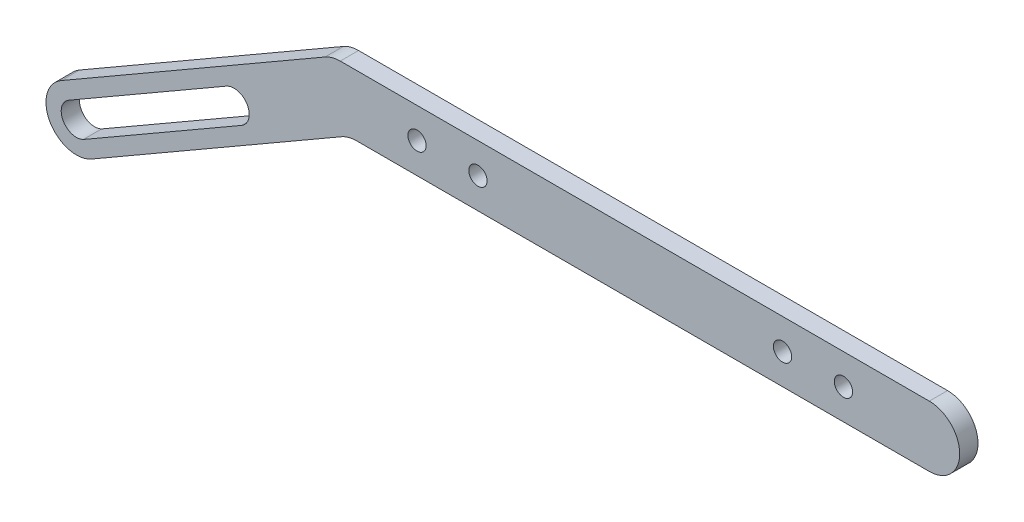
ISO-10303-21;
HEADER;
FILE_DESCRIPTION(('STEP AP214'),'2;1');
FILE_NAME('part.step','',(''),(''),'','','');
FILE_SCHEMA(('AUTOMOTIVE_DESIGN { 1 0 10303 214 1 1 1 1 }'));
ENDSEC;
DATA;
#1=APPLICATION_CONTEXT('core data for automotive mechanical design processes');
#2=APPLICATION_PROTOCOL_DEFINITION('international standard','automotive_design',2000,#1);
#3=PRODUCT_CONTEXT('',#1,'mechanical');
#4=PRODUCT('Part','Part','',(#3));
#5=PRODUCT_RELATED_PRODUCT_CATEGORY('part','',(#4));
#6=PRODUCT_DEFINITION_FORMATION('','',#4);
#7=PRODUCT_DEFINITION_CONTEXT('part definition',#1,'design');
#8=PRODUCT_DEFINITION('design','',#6,#7);
#9=PRODUCT_DEFINITION_SHAPE('','',#8);
#10=(LENGTH_UNIT() NAMED_UNIT(*) SI_UNIT(.MILLI.,.METRE.));
#11=(NAMED_UNIT(*) PLANE_ANGLE_UNIT() SI_UNIT($,.RADIAN.));
#12=(NAMED_UNIT(*) SI_UNIT($,.STERADIAN.) SOLID_ANGLE_UNIT());
#13=UNCERTAINTY_MEASURE_WITH_UNIT(LENGTH_MEASURE(1.E-05),#10,'distance_accuracy_value','');
#14=(GEOMETRIC_REPRESENTATION_CONTEXT(3) GLOBAL_UNCERTAINTY_ASSIGNED_CONTEXT((#13)) GLOBAL_UNIT_ASSIGNED_CONTEXT((#10,
#11,#12)) REPRESENTATION_CONTEXT('',''));
#15=CARTESIAN_POINT('',(0.,0.,0.));
#16=DIRECTION('',(0.,0.,1.));
#17=DIRECTION('',(1.,0.,0.));
#18=AXIS2_PLACEMENT_3D('',#15,#16,#17);
#19=CARTESIAN_POINT('',(-53.9030759756576,0.,3.));
#20=DIRECTION('',(0.,0.,-1.));
#21=DIRECTION('',(-1.,0.,0.));
#22=AXIS2_PLACEMENT_3D('',#19,#20,#21);
#23=CYLINDRICAL_SURFACE('',#22,5.);
#24=CARTESIAN_POINT('',(-53.9030759756576,0.,0.));
#25=DIRECTION('',(0.,0.,1.));
#26=DIRECTION('',(1.,0.,0.));
#27=AXIS2_PLACEMENT_3D('',#24,#25,#26);
#28=CIRCLE('',#27,5.);
#29=CARTESIAN_POINT('',(-53.9030759756576,5.,0.));
#30=VERTEX_POINT('',#29);
#31=CARTESIAN_POINT('',(-56.4030759756576,4.33012701892221,0.));
#32=VERTEX_POINT('',#31);
#33=EDGE_CURVE('E160',#30,#32,#28,.T.);
#34=ORIENTED_EDGE('',*,*,#33,.T.);
#35=DIRECTION('',(0.,0.,-1.));
#36=VECTOR('',#35,1.);
#37=CARTESIAN_POINT('',(-56.4030759756576,4.33012701892221,3.));
#38=LINE('',#37,#36);
#39=CARTESIAN_POINT('',(-56.4030759756576,4.33012701892221,3.));
#40=VERTEX_POINT('',#39);
#41=EDGE_CURVE('E11',#40,#32,#38,.T.);
#42=ORIENTED_EDGE('',*,*,#41,.F.);
#43=CARTESIAN_POINT('',(-53.9030759756576,0.,3.));
#44=DIRECTION('',(0.,0.,1.));
#45=DIRECTION('',(1.,0.,0.));
#46=AXIS2_PLACEMENT_3D('',#43,#44,#45);
#47=CIRCLE('',#46,5.);
#48=CARTESIAN_POINT('',(-53.9030759756576,5.,3.));
#49=VERTEX_POINT('',#48);
#50=EDGE_CURVE('E164',#49,#40,#47,.T.);
#51=ORIENTED_EDGE('',*,*,#50,.F.);
#52=DIRECTION('',(0.,0.,-1.));
#53=VECTOR('',#52,1.);
#54=CARTESIAN_POINT('',(-53.9030759756576,5.,3.));
#55=LINE('',#54,#53);
#56=EDGE_CURVE('E186',#49,#30,#55,.T.);
#57=ORIENTED_EDGE('',*,*,#56,.T.);
#58=EDGE_LOOP('',(#34,#42,#51,#57));
#59=FACE_BOUND('',#58,.T.);
#60=ADVANCED_FACE('F35',(#59),#23,.T.);
#61=CARTESIAN_POINT('',(-56.4030759756576,4.33012701892221,3.));
#62=DIRECTION('',(0.499999999999995,-0.866025403784442,0.));
#63=DIRECTION('',(0.866025403784442,0.499999999999995,0.));
#64=AXIS2_PLACEMENT_3D('',#61,#62,#63);
#65=PLANE('',#64);
#66=DIRECTION('',(-0.866025403784442,-0.499999999999995,0.));
#67=VECTOR('',#66,1.);
#68=CARTESIAN_POINT('',(-56.4030759756576,4.33012701892221,0.));
#69=LINE('',#68,#67);
#70=CARTESIAN_POINT('',(-99.7170096490511,-20.6771842470727,0.));
#71=VERTEX_POINT('',#70);
#72=EDGE_CURVE('E189',#32,#71,#69,.T.);
#73=ORIENTED_EDGE('',*,*,#72,.T.);
#74=DIRECTION('',(0.,0.,-1.));
#75=VECTOR('',#74,1.);
#76=CARTESIAN_POINT('',(-99.7170096490511,-20.6771842470727,3.));
#77=LINE('',#76,#75);
#78=CARTESIAN_POINT('',(-99.7170096490511,-20.6771842470727,3.));
#79=VERTEX_POINT('',#78);
#80=EDGE_CURVE('E42',#79,#71,#77,.T.);
#81=ORIENTED_EDGE('',*,*,#80,.F.);
#82=DIRECTION('',(-0.866025403784442,-0.499999999999995,0.));
#83=VECTOR('',#82,1.);
#84=CARTESIAN_POINT('',(-56.4030759756576,4.33012701892221,3.));
#85=LINE('',#84,#83);
#86=EDGE_CURVE('E167',#40,#79,#85,.T.);
#87=ORIENTED_EDGE('',*,*,#86,.F.);
#88=ORIENTED_EDGE('',*,*,#41,.T.);
#89=EDGE_LOOP('',(#73,#81,#87,#88));
#90=FACE_BOUND('',#89,.T.);
#91=ADVANCED_FACE('F225',(#90),#65,.F.);
#92=CARTESIAN_POINT('',(-97.217009649051,-25.0073112659952,3.));
#93=DIRECTION('',(0.,0.,-1.));
#94=DIRECTION('',(-1.,0.,0.));
#95=AXIS2_PLACEMENT_3D('',#92,#93,#94);
#96=CYLINDRICAL_SURFACE('',#95,5.00000000000028);
#97=CARTESIAN_POINT('',(-97.217009649051,-25.0073112659952,0.));
#98=DIRECTION('',(0.,0.,-1.));
#99=DIRECTION('',(-1.,0.,0.));
#100=AXIS2_PLACEMENT_3D('',#97,#98,#99);
#101=CIRCLE('',#100,5.00000000000028);
#102=CARTESIAN_POINT('',(-94.7170096490508,-29.3374382849176,0.));
#103=VERTEX_POINT('',#102);
#104=EDGE_CURVE('E192',#103,#71,#101,.T.);
#105=ORIENTED_EDGE('',*,*,#104,.F.);
#106=DIRECTION('',(0.,0.,-1.));
#107=VECTOR('',#106,1.);
#108=CARTESIAN_POINT('',(-94.7170096490508,-29.3374382849176,3.));
#109=LINE('',#108,#107);
#110=CARTESIAN_POINT('',(-94.7170096490508,-29.3374382849176,3.));
#111=VERTEX_POINT('',#110);
#112=EDGE_CURVE('E218',#111,#103,#109,.T.);
#113=ORIENTED_EDGE('',*,*,#112,.F.);
#114=CARTESIAN_POINT('',(-97.217009649051,-25.0073112659952,3.));
#115=DIRECTION('',(0.,0.,-1.));
#116=DIRECTION('',(-1.,0.,0.));
#117=AXIS2_PLACEMENT_3D('',#114,#115,#116);
#118=CIRCLE('',#117,5.00000000000028);
#119=EDGE_CURVE('E170',#111,#79,#118,.T.);
#120=ORIENTED_EDGE('',*,*,#119,.T.);
#121=ORIENTED_EDGE('',*,*,#80,.T.);
#122=EDGE_LOOP('',(#105,#113,#120,#121));
#123=FACE_BOUND('',#122,.T.);
#124=ADVANCED_FACE('F222',(#123),#96,.T.);
#125=CARTESIAN_POINT('',(-53.7235840513453,-5.66987298107779,3.));
#126=DIRECTION('',(0.499999999999995,-0.866025403784441,0.));
#127=DIRECTION('',(0.866025403784442,0.499999999999995,0.));
#128=AXIS2_PLACEMENT_3D('',#125,#126,#127);
#129=PLANE('',#128);
#130=DIRECTION('',(-0.866025403784442,-0.499999999999995,0.));
#131=VECTOR('',#130,1.);
#132=CARTESIAN_POINT('',(-53.7235840513453,-5.66987298107779,0.));
#133=LINE('',#132,#131);
#134=CARTESIAN_POINT('',(-53.7235840513453,-5.66987298107779,0.));
#135=VERTEX_POINT('',#134);
#136=EDGE_CURVE('E195',#135,#103,#133,.T.);
#137=ORIENTED_EDGE('',*,*,#136,.F.);
#138=DIRECTION('',(0.,0.,-1.));
#139=VECTOR('',#138,1.);
#140=CARTESIAN_POINT('',(-53.7235840513453,-5.66987298107779,3.));
#141=LINE('',#140,#139);
#142=CARTESIAN_POINT('',(-53.7235840513453,-5.66987298107779,3.));
#143=VERTEX_POINT('',#142);
#144=EDGE_CURVE('E216',#143,#135,#141,.T.);
#145=ORIENTED_EDGE('',*,*,#144,.F.);
#146=DIRECTION('',(-0.866025403784442,-0.499999999999995,0.));
#147=VECTOR('',#146,1.);
#148=CARTESIAN_POINT('',(-53.7235840513453,-5.66987298107779,3.));
#149=LINE('',#148,#147);
#150=EDGE_CURVE('E173',#143,#111,#149,.T.);
#151=ORIENTED_EDGE('',*,*,#150,.T.);
#152=ORIENTED_EDGE('',*,*,#112,.T.);
#153=EDGE_LOOP('',(#137,#145,#151,#152));
#154=FACE_BOUND('',#153,.T.);
#155=ADVANCED_FACE('F232',(#154),#129,.T.);
#156=CARTESIAN_POINT('',(-51.2235840513454,-10.,3.));
#157=DIRECTION('',(0.,0.,-1.));
#158=DIRECTION('',(-1.,0.,0.));
#159=AXIS2_PLACEMENT_3D('',#156,#157,#158);
#160=CYLINDRICAL_SURFACE('',#159,5.);
#161=CARTESIAN_POINT('',(-51.2235840513454,-10.,0.));
#162=DIRECTION('',(0.,0.,1.));
#163=DIRECTION('',(1.,0.,0.));
#164=AXIS2_PLACEMENT_3D('',#161,#162,#163);
#165=CIRCLE('',#164,5.);
#166=CARTESIAN_POINT('',(-51.2235840513454,-5.,0.));
#167=VERTEX_POINT('',#166);
#168=EDGE_CURVE('E198',#167,#135,#165,.T.);
#169=ORIENTED_EDGE('',*,*,#168,.F.);
#170=DIRECTION('',(0.,0.,-1.));
#171=VECTOR('',#170,1.);
#172=CARTESIAN_POINT('',(-51.2235840513454,-5.,3.));
#173=LINE('',#172,#171);
#174=CARTESIAN_POINT('',(-51.2235840513454,-5.,3.));
#175=VERTEX_POINT('',#174);
#176=EDGE_CURVE('E214',#175,#167,#173,.T.);
#177=ORIENTED_EDGE('',*,*,#176,.F.);
#178=CARTESIAN_POINT('',(-51.2235840513454,-10.,3.));
#179=DIRECTION('',(0.,0.,1.));
#180=DIRECTION('',(1.,0.,0.));
#181=AXIS2_PLACEMENT_3D('',#178,#179,#180);
#182=CIRCLE('',#181,5.);
#183=EDGE_CURVE('E176',#175,#143,#182,.T.);
#184=ORIENTED_EDGE('',*,*,#183,.T.);
#185=ORIENTED_EDGE('',*,*,#144,.T.);
#186=EDGE_LOOP('',(#169,#177,#184,#185));
#187=FACE_BOUND('',#186,.T.);
#188=ADVANCED_FACE('F251',(#187),#160,.F.);
#189=CARTESIAN_POINT('',(-51.2235840513454,-5.,3.));
#190=DIRECTION('',(0.,1.,0.));
#191=DIRECTION('',(0.,0.,1.));
#192=AXIS2_PLACEMENT_3D('',#189,#190,#191);
#193=PLANE('',#192);
#194=DIRECTION('',(1.,0.,0.));
#195=VECTOR('',#194,1.);
#196=CARTESIAN_POINT('',(-51.2235840513454,-5.,0.));
#197=LINE('',#196,#195);
#198=CARTESIAN_POINT('',(42.7829903509491,-5.,0.));
#199=VERTEX_POINT('',#198);
#200=EDGE_CURVE('E201',#167,#199,#197,.T.);
#201=ORIENTED_EDGE('',*,*,#200,.T.);
#202=DIRECTION('',(0.,0.,-1.));
#203=VECTOR('',#202,1.);
#204=CARTESIAN_POINT('',(42.7829903509491,-5.,3.));
#205=LINE('',#204,#203);
#206=CARTESIAN_POINT('',(42.7829903509491,-5.,3.));
#207=VERTEX_POINT('',#206);
#208=EDGE_CURVE('E211',#207,#199,#205,.T.);
#209=ORIENTED_EDGE('',*,*,#208,.F.);
#210=DIRECTION('',(1.,0.,0.));
#211=VECTOR('',#210,1.);
#212=CARTESIAN_POINT('',(-51.2235840513454,-5.,3.));
#213=LINE('',#212,#211);
#214=EDGE_CURVE('E179',#175,#207,#213,.T.);
#215=ORIENTED_EDGE('',*,*,#214,.F.);
#216=ORIENTED_EDGE('',*,*,#176,.T.);
#217=EDGE_LOOP('',(#201,#209,#215,#216));
#218=FACE_BOUND('',#217,.T.);
#219=ADVANCED_FACE('F253',(#218),#193,.F.);
#220=CARTESIAN_POINT('',(42.7829903509491,0.,3.));
#221=DIRECTION('',(0.,0.,-1.));
#222=DIRECTION('',(-1.,0.,0.));
#223=AXIS2_PLACEMENT_3D('',#220,#221,#222);
#224=CYLINDRICAL_SURFACE('',#223,5.00000000000006);
#225=CARTESIAN_POINT('',(42.7829903509491,0.,0.));
#226=DIRECTION('',(0.,0.,1.));
#227=DIRECTION('',(1.,0.,0.));
#228=AXIS2_PLACEMENT_3D('',#225,#226,#227);
#229=CIRCLE('',#228,5.00000000000006);
#230=CARTESIAN_POINT('',(42.7829903509491,5.00000000000006,0.));
#231=VERTEX_POINT('',#230);
#232=EDGE_CURVE('E203',#199,#231,#229,.T.);
#233=ORIENTED_EDGE('',*,*,#232,.T.);
#234=DIRECTION('',(0.,0.,-1.));
#235=VECTOR('',#234,1.);
#236=CARTESIAN_POINT('',(42.7829903509491,5.00000000000006,3.));
#237=LINE('',#236,#235);
#238=CARTESIAN_POINT('',(42.7829903509491,5.00000000000006,3.));
#239=VERTEX_POINT('',#238);
#240=EDGE_CURVE('E209',#239,#231,#237,.T.);
#241=ORIENTED_EDGE('',*,*,#240,.F.);
#242=CARTESIAN_POINT('',(42.7829903509491,0.,3.));
#243=DIRECTION('',(0.,0.,1.));
#244=DIRECTION('',(1.,0.,0.));
#245=AXIS2_PLACEMENT_3D('',#242,#243,#244);
#246=CIRCLE('',#245,5.00000000000006);
#247=EDGE_CURVE('E181',#207,#239,#246,.T.);
#248=ORIENTED_EDGE('',*,*,#247,.F.);
#249=ORIENTED_EDGE('',*,*,#208,.T.);
#250=EDGE_LOOP('',(#233,#241,#248,#249));
#251=FACE_BOUND('',#250,.T.);
#252=ADVANCED_FACE('F247',(#251),#224,.T.);
#253=CARTESIAN_POINT('',(-53.9030759756576,5.,3.));
#254=DIRECTION('',(0.,1.,0.));
#255=DIRECTION('',(-1.,0.,0.));
#256=AXIS2_PLACEMENT_3D('',#253,#254,#255);
#257=PLANE('',#256);
#258=DIRECTION('',(1.,0.,0.));
#259=VECTOR('',#258,1.);
#260=CARTESIAN_POINT('',(-53.9030759756576,5.,0.));
#261=LINE('',#260,#259);
#262=EDGE_CURVE('E168',#30,#231,#261,.T.);
#263=ORIENTED_EDGE('',*,*,#262,.F.);
#264=ORIENTED_EDGE('',*,*,#56,.F.);
#265=DIRECTION('',(1.,0.,0.));
#266=VECTOR('',#265,1.);
#267=CARTESIAN_POINT('',(-53.9030759756576,5.,3.));
#268=LINE('',#267,#266);
#269=EDGE_CURVE('E183',#49,#239,#268,.T.);
#270=ORIENTED_EDGE('',*,*,#269,.T.);
#271=ORIENTED_EDGE('',*,*,#240,.T.);
#272=EDGE_LOOP('',(#263,#264,#270,#271));
#273=FACE_BOUND('',#272,.T.);
#274=ADVANCED_FACE('F243',(#273),#257,.T.);
#275=CARTESIAN_POINT('',(-53.9030759756576,0.,3.));
#276=DIRECTION('',(0.,0.,1.));
#277=DIRECTION('',(1.,0.,0.));
#278=AXIS2_PLACEMENT_3D('',#275,#276,#277);
#279=PLANE('',#278);
#280=CARTESIAN_POINT('',(28.6964066085863,-2.6402491304367E-12,3.));
#281=DIRECTION('',(0.,0.,-1.));
#282=DIRECTION('',(-1.,0.,0.));
#283=AXIS2_PLACEMENT_3D('',#280,#281,#282);
#284=CIRCLE('',#283,1.5);
#285=CARTESIAN_POINT('',(27.1964066085863,-2.6402491304367E-12,3.));
#286=VERTEX_POINT('',#285);
#287=EDGE_CURVE('E398',#286,#286,#284,.T.);
#288=ORIENTED_EDGE('',*,*,#287,.T.);
#289=EDGE_LOOP('',(#288));
#290=FACE_BOUND('',#289,.T.);
#291=CARTESIAN_POINT('',(18.6964066085863,-1.83186799063151E-12,3.));
#292=DIRECTION('',(0.,0.,-1.));
#293=DIRECTION('',(-1.,0.,0.));
#294=AXIS2_PLACEMENT_3D('',#291,#292,#293);
#295=CIRCLE('',#294,1.5);
#296=CARTESIAN_POINT('',(17.1964066085863,-1.83186799063151E-12,3.));
#297=VERTEX_POINT('',#296);
#298=EDGE_CURVE('E406',#297,#297,#295,.T.);
#299=ORIENTED_EDGE('',*,*,#298,.T.);
#300=EDGE_LOOP('',(#299));
#301=FACE_BOUND('',#300,.T.);
#302=CARTESIAN_POINT('',(-41.3035933914003,0.,3.));
#303=DIRECTION('',(0.,0.,1.));
#304=DIRECTION('',(1.,0.,0.));
#305=AXIS2_PLACEMENT_3D('',#302,#303,#304);
#306=CIRCLE('',#305,1.5);
#307=CARTESIAN_POINT('',(-39.8035933914003,0.,3.));
#308=VERTEX_POINT('',#307);
#309=EDGE_CURVE('E409',#308,#308,#306,.T.);
#310=ORIENTED_EDGE('',*,*,#309,.F.);
#311=EDGE_LOOP('',(#310));
#312=FACE_BOUND('',#311,.T.);
#313=CARTESIAN_POINT('',(-31.3035933914003,0.,3.));
#314=DIRECTION('',(0.,0.,1.));
#315=DIRECTION('',(1.,0.,0.));
#316=AXIS2_PLACEMENT_3D('',#313,#314,#315);
#317=CIRCLE('',#316,1.5);
#318=CARTESIAN_POINT('',(-29.8035933914003,0.,3.));
#319=VERTEX_POINT('',#318);
#320=EDGE_CURVE('E147',#319,#319,#317,.T.);
#321=ORIENTED_EDGE('',*,*,#320,.F.);
#322=EDGE_LOOP('',(#321));
#323=FACE_BOUND('',#322,.T.);
#324=CARTESIAN_POINT('',(-97.217009649051,-25.0073112659952,3.));
#325=DIRECTION('',(0.,0.,1.));
#326=DIRECTION('',(1.,0.,0.));
#327=AXIS2_PLACEMENT_3D('',#324,#325,#326);
#328=CIRCLE('',#327,2.5);
#329=CARTESIAN_POINT('',(-98.334747096445,-22.7710950423949,3.));
#330=VERTEX_POINT('',#329);
#331=CARTESIAN_POINT('',(-96.0834090349458,-27.2355279627508,3.));
#332=VERTEX_POINT('',#331);
#333=EDGE_CURVE('E49',#330,#332,#328,.T.);
#334=ORIENTED_EDGE('',*,*,#333,.F.);
#335=DIRECTION('',(-0.866025403784435,-0.500000000000006,0.));
#336=VECTOR('',#335,1.);
#337=CARTESIAN_POINT('',(-98.334747096445,-22.7710950423949,3.));
#338=LINE('',#337,#336);
#339=CARTESIAN_POINT('',(-72.5980598365622,-7.91201172485215,3.));
#340=VERTEX_POINT('',#339);
#341=EDGE_CURVE('E141',#340,#330,#338,.T.);
#342=ORIENTED_EDGE('',*,*,#341,.F.);
#343=CARTESIAN_POINT('',(-71.3480598365622,-10.0770752343132,3.));
#344=DIRECTION('',(0.,0.,1.));
#345=DIRECTION('',(-1.,0.,0.));
#346=AXIS2_PLACEMENT_3D('',#343,#344,#345);
#347=CIRCLE('',#346,2.5);
#348=CARTESIAN_POINT('',(-70.0986385707493,-12.2424727729963,3.));
#349=VERTEX_POINT('',#348);
#350=EDGE_CURVE('E144',#349,#340,#347,.T.);
#351=ORIENTED_EDGE('',*,*,#350,.F.);
#352=DIRECTION('',(0.866159015473215,0.49976850632515,0.));
#353=VECTOR('',#352,1.);
#354=CARTESIAN_POINT('',(-96.0834090349458,-27.2355279627508,3.));
#355=LINE('',#354,#353);
#356=EDGE_CURVE('E153',#332,#349,#355,.T.);
#357=ORIENTED_EDGE('',*,*,#356,.F.);
#358=EDGE_LOOP('',(#334,#342,#351,#357));
#359=FACE_BOUND('',#358,.T.);
#360=ORIENTED_EDGE('',*,*,#50,.T.);
#361=ORIENTED_EDGE('',*,*,#86,.T.);
#362=ORIENTED_EDGE('',*,*,#119,.F.);
#363=ORIENTED_EDGE('',*,*,#150,.F.);
#364=ORIENTED_EDGE('',*,*,#183,.F.);
#365=ORIENTED_EDGE('',*,*,#214,.T.);
#366=ORIENTED_EDGE('',*,*,#247,.T.);
#367=ORIENTED_EDGE('',*,*,#269,.F.);
#368=EDGE_LOOP('',(#360,#361,#362,#363,#364,#365,#366,#367));
#369=FACE_BOUND('',#368,.T.);
#370=ADVANCED_FACE('F235',(#290,#301,#312,#323,#359,#369),#279,.T.);
#371=CARTESIAN_POINT('',(-53.9030759756576,0.,0.));
#372=DIRECTION('',(0.,0.,1.));
#373=DIRECTION('',(1.,0.,0.));
#374=AXIS2_PLACEMENT_3D('',#371,#372,#373);
#375=PLANE('',#374);
#376=CARTESIAN_POINT('',(28.6964066085863,-2.6402491304367E-12,0.));
#377=DIRECTION('',(0.,0.,-1.));
#378=DIRECTION('',(-1.,0.,0.));
#379=AXIS2_PLACEMENT_3D('',#376,#377,#378);
#380=CIRCLE('',#379,1.5);
#381=CARTESIAN_POINT('',(27.1964066085863,-2.6402491304367E-12,0.));
#382=VERTEX_POINT('',#381);
#383=EDGE_CURVE('E401',#382,#382,#380,.T.);
#384=ORIENTED_EDGE('',*,*,#383,.F.);
#385=EDGE_LOOP('',(#384));
#386=FACE_BOUND('',#385,.T.);
#387=CARTESIAN_POINT('',(18.6964066085863,-1.83186799063151E-12,0.));
#388=DIRECTION('',(0.,0.,-1.));
#389=DIRECTION('',(-1.,0.,0.));
#390=AXIS2_PLACEMENT_3D('',#387,#388,#389);
#391=CIRCLE('',#390,1.5);
#392=CARTESIAN_POINT('',(17.1964066085863,-1.83186799063151E-12,0.));
#393=VERTEX_POINT('',#392);
#394=EDGE_CURVE('E403',#393,#393,#391,.T.);
#395=ORIENTED_EDGE('',*,*,#394,.F.);
#396=EDGE_LOOP('',(#395));
#397=FACE_BOUND('',#396,.T.);
#398=CARTESIAN_POINT('',(-41.3035933914003,0.,0.));
#399=DIRECTION('',(0.,0.,1.));
#400=DIRECTION('',(1.,0.,0.));
#401=AXIS2_PLACEMENT_3D('',#398,#399,#400);
#402=CIRCLE('',#401,1.5);
#403=CARTESIAN_POINT('',(-39.8035933914003,0.,0.));
#404=VERTEX_POINT('',#403);
#405=EDGE_CURVE('E412',#404,#404,#402,.T.);
#406=ORIENTED_EDGE('',*,*,#405,.T.);
#407=EDGE_LOOP('',(#406));
#408=FACE_BOUND('',#407,.T.);
#409=CARTESIAN_POINT('',(-31.3035933914003,0.,0.));
#410=DIRECTION('',(0.,0.,1.));
#411=DIRECTION('',(1.,0.,0.));
#412=AXIS2_PLACEMENT_3D('',#409,#410,#411);
#413=CIRCLE('',#412,1.5);
#414=CARTESIAN_POINT('',(-29.8035933914003,0.,0.));
#415=VERTEX_POINT('',#414);
#416=EDGE_CURVE('E154',#415,#415,#413,.T.);
#417=ORIENTED_EDGE('',*,*,#416,.T.);
#418=EDGE_LOOP('',(#417));
#419=FACE_BOUND('',#418,.T.);
#420=DIRECTION('',(-0.866025403784435,-0.500000000000006,0.));
#421=VECTOR('',#420,1.);
#422=CARTESIAN_POINT('',(-98.334747096445,-22.7710950423949,0.));
#423=LINE('',#422,#421);
#424=CARTESIAN_POINT('',(-72.5980598365622,-7.91201172485215,0.));
#425=VERTEX_POINT('',#424);
#426=CARTESIAN_POINT('',(-98.334747096445,-22.7710950423949,0.));
#427=VERTEX_POINT('',#426);
#428=EDGE_CURVE('E131',#425,#427,#423,.T.);
#429=ORIENTED_EDGE('',*,*,#428,.T.);
#430=CARTESIAN_POINT('',(-97.217009649051,-25.0073112659952,0.));
#431=DIRECTION('',(0.,0.,1.));
#432=DIRECTION('',(1.,0.,0.));
#433=AXIS2_PLACEMENT_3D('',#430,#431,#432);
#434=CIRCLE('',#433,2.5);
#435=CARTESIAN_POINT('',(-96.0834090349458,-27.2355279627508,0.));
#436=VERTEX_POINT('',#435);
#437=EDGE_CURVE('E125',#427,#436,#434,.T.);
#438=ORIENTED_EDGE('',*,*,#437,.T.);
#439=DIRECTION('',(0.866159015473215,0.49976850632515,0.));
#440=VECTOR('',#439,1.);
#441=CARTESIAN_POINT('',(-96.0834090349458,-27.2355279627508,0.));
#442=LINE('',#441,#440);
#443=CARTESIAN_POINT('',(-70.0986385707493,-12.2424727729963,0.));
#444=VERTEX_POINT('',#443);
#445=EDGE_CURVE('E134',#436,#444,#442,.T.);
#446=ORIENTED_EDGE('',*,*,#445,.T.);
#447=CARTESIAN_POINT('',(-71.3480598365622,-10.0770752343132,0.));
#448=DIRECTION('',(0.,0.,1.));
#449=DIRECTION('',(-1.,0.,0.));
#450=AXIS2_PLACEMENT_3D('',#447,#448,#449);
#451=CIRCLE('',#450,2.5);
#452=EDGE_CURVE('E57',#444,#425,#451,.T.);
#453=ORIENTED_EDGE('',*,*,#452,.T.);
#454=EDGE_LOOP('',(#429,#438,#446,#453));
#455=FACE_BOUND('',#454,.T.);
#456=ORIENTED_EDGE('',*,*,#33,.F.);
#457=ORIENTED_EDGE('',*,*,#262,.T.);
#458=ORIENTED_EDGE('',*,*,#232,.F.);
#459=ORIENTED_EDGE('',*,*,#200,.F.);
#460=ORIENTED_EDGE('',*,*,#168,.T.);
#461=ORIENTED_EDGE('',*,*,#136,.T.);
#462=ORIENTED_EDGE('',*,*,#104,.T.);
#463=ORIENTED_EDGE('',*,*,#72,.F.);
#464=EDGE_LOOP('',(#456,#457,#458,#459,#460,#461,#462,#463));
#465=FACE_BOUND('',#464,.T.);
#466=ADVANCED_FACE('F138',(#386,#397,#408,#419,#455,#465),#375,.F.);
#467=CARTESIAN_POINT('',(-97.217009649051,-25.0073112659952,0.));
#468=DIRECTION('',(0.,0.,1.));
#469=DIRECTION('',(1.,0.,0.));
#470=AXIS2_PLACEMENT_3D('',#467,#468,#469);
#471=CYLINDRICAL_SURFACE('',#470,2.5);
#472=ORIENTED_EDGE('',*,*,#333,.T.);
#473=DIRECTION('',(0.,0.,1.));
#474=VECTOR('',#473,1.);
#475=CARTESIAN_POINT('',(-96.0834090349458,-27.2355279627508,0.));
#476=LINE('',#475,#474);
#477=EDGE_CURVE('E121',#436,#332,#476,.T.);
#478=ORIENTED_EDGE('',*,*,#477,.F.);
#479=ORIENTED_EDGE('',*,*,#437,.F.);
#480=DIRECTION('',(0.,0.,1.));
#481=VECTOR('',#480,1.);
#482=CARTESIAN_POINT('',(-98.334747096445,-22.7710950423949,0.));
#483=LINE('',#482,#481);
#484=EDGE_CURVE('E158',#427,#330,#483,.T.);
#485=ORIENTED_EDGE('',*,*,#484,.T.);
#486=EDGE_LOOP('',(#472,#478,#479,#485));
#487=FACE_BOUND('',#486,.T.);
#488=ADVANCED_FACE('F123',(#487),#471,.F.);
#489=CARTESIAN_POINT('',(-98.334747096445,-22.7710950423949,0.));
#490=DIRECTION('',(-0.500000000000006,0.866025403784435,0.));
#491=DIRECTION('',(-0.866025403784435,-0.500000000000006,0.));
#492=AXIS2_PLACEMENT_3D('',#489,#490,#491);
#493=PLANE('',#492);
#494=ORIENTED_EDGE('',*,*,#341,.T.);
#495=ORIENTED_EDGE('',*,*,#484,.F.);
#496=ORIENTED_EDGE('',*,*,#428,.F.);
#497=DIRECTION('',(0.,0.,1.));
#498=VECTOR('',#497,1.);
#499=CARTESIAN_POINT('',(-72.5980598365622,-7.91201172485215,0.));
#500=LINE('',#499,#498);
#501=EDGE_CURVE('E161',#425,#340,#500,.T.);
#502=ORIENTED_EDGE('',*,*,#501,.T.);
#503=EDGE_LOOP('',(#494,#495,#496,#502));
#504=FACE_BOUND('',#503,.T.);
#505=ADVANCED_FACE('F309',(#504),#493,.F.);
#506=CARTESIAN_POINT('',(-71.3480598365622,-10.0770752343132,0.));
#507=DIRECTION('',(0.,0.,1.));
#508=DIRECTION('',(1.,0.,0.));
#509=AXIS2_PLACEMENT_3D('',#506,#507,#508);
#510=CYLINDRICAL_SURFACE('',#509,2.5);
#511=ORIENTED_EDGE('',*,*,#350,.T.);
#512=ORIENTED_EDGE('',*,*,#501,.F.);
#513=ORIENTED_EDGE('',*,*,#452,.F.);
#514=DIRECTION('',(0.,0.,1.));
#515=VECTOR('',#514,1.);
#516=CARTESIAN_POINT('',(-70.0986385707493,-12.2424727729963,0.));
#517=LINE('',#516,#515);
#518=EDGE_CURVE('E130',#444,#349,#517,.T.);
#519=ORIENTED_EDGE('',*,*,#518,.T.);
#520=EDGE_LOOP('',(#511,#512,#513,#519));
#521=FACE_BOUND('',#520,.T.);
#522=ADVANCED_FACE('F320',(#521),#510,.F.);
#523=CARTESIAN_POINT('',(-96.0834090349458,-27.2355279627508,0.));
#524=DIRECTION('',(0.49976850632515,-0.866159015473214,0.));
#525=DIRECTION('',(0.866159015473215,0.49976850632515,0.));
#526=AXIS2_PLACEMENT_3D('',#523,#524,#525);
#527=PLANE('',#526);
#528=ORIENTED_EDGE('',*,*,#356,.T.);
#529=ORIENTED_EDGE('',*,*,#518,.F.);
#530=ORIENTED_EDGE('',*,*,#445,.F.);
#531=ORIENTED_EDGE('',*,*,#477,.T.);
#532=EDGE_LOOP('',(#528,#529,#530,#531));
#533=FACE_BOUND('',#532,.T.);
#534=ADVANCED_FACE('F135',(#533),#527,.F.);
#535=CARTESIAN_POINT('',(-31.3035933914003,0.,0.));
#536=DIRECTION('',(0.,0.,1.));
#537=DIRECTION('',(1.,0.,0.));
#538=AXIS2_PLACEMENT_3D('',#535,#536,#537);
#539=CYLINDRICAL_SURFACE('',#538,1.5);
#540=ORIENTED_EDGE('',*,*,#416,.F.);
#541=EDGE_LOOP('',(#540));
#542=FACE_BOUND('',#541,.T.);
#543=ORIENTED_EDGE('',*,*,#320,.T.);
#544=EDGE_LOOP('',(#543));
#545=FACE_BOUND('',#544,.T.);
#546=ADVANCED_FACE('F338',(#542,#545),#539,.F.);
#547=CARTESIAN_POINT('',(-41.3035933914003,0.,0.));
#548=DIRECTION('',(0.,0.,1.));
#549=DIRECTION('',(1.,0.,0.));
#550=AXIS2_PLACEMENT_3D('',#547,#548,#549);
#551=CYLINDRICAL_SURFACE('',#550,1.5);
#552=ORIENTED_EDGE('',*,*,#405,.F.);
#553=EDGE_LOOP('',(#552));
#554=FACE_BOUND('',#553,.T.);
#555=ORIENTED_EDGE('',*,*,#309,.T.);
#556=EDGE_LOOP('',(#555));
#557=FACE_BOUND('',#556,.T.);
#558=ADVANCED_FACE('F347',(#554,#557),#551,.F.);
#559=CARTESIAN_POINT('',(18.6964066085863,-1.83186799063151E-12,3.));
#560=DIRECTION('',(0.,0.,-1.));
#561=DIRECTION('',(-1.,0.,0.));
#562=AXIS2_PLACEMENT_3D('',#559,#560,#561);
#563=CYLINDRICAL_SURFACE('',#562,1.5);
#564=ORIENTED_EDGE('',*,*,#298,.F.);
#565=EDGE_LOOP('',(#564));
#566=FACE_BOUND('',#565,.T.);
#567=ORIENTED_EDGE('',*,*,#394,.T.);
#568=EDGE_LOOP('',(#567));
#569=FACE_BOUND('',#568,.T.);
#570=ADVANCED_FACE('F357',(#566,#569),#563,.F.);
#571=CARTESIAN_POINT('',(28.6964066085863,-2.6402491304367E-12,3.));
#572=DIRECTION('',(0.,0.,-1.));
#573=DIRECTION('',(-1.,0.,0.));
#574=AXIS2_PLACEMENT_3D('',#571,#572,#573);
#575=CYLINDRICAL_SURFACE('',#574,1.5);
#576=ORIENTED_EDGE('',*,*,#287,.F.);
#577=EDGE_LOOP('',(#576));
#578=FACE_BOUND('',#577,.T.);
#579=ORIENTED_EDGE('',*,*,#383,.T.);
#580=EDGE_LOOP('',(#579));
#581=FACE_BOUND('',#580,.T.);
#582=ADVANCED_FACE('F381',(#578,#581),#575,.F.);
#583=CLOSED_SHELL('',(#60,#91,#124,#155,#188,#219,#252,#274,#370,#466,#488,#505,#522,#534,#546,
#558,#570,#582));
#584=MANIFOLD_SOLID_BREP('B2',#583);
#585=ADVANCED_BREP_SHAPE_REPRESENTATION('',(#18,#584),#14);
#586=SHAPE_DEFINITION_REPRESENTATION(#9,#585);
ENDSEC;
END-ISO-10303-21;
